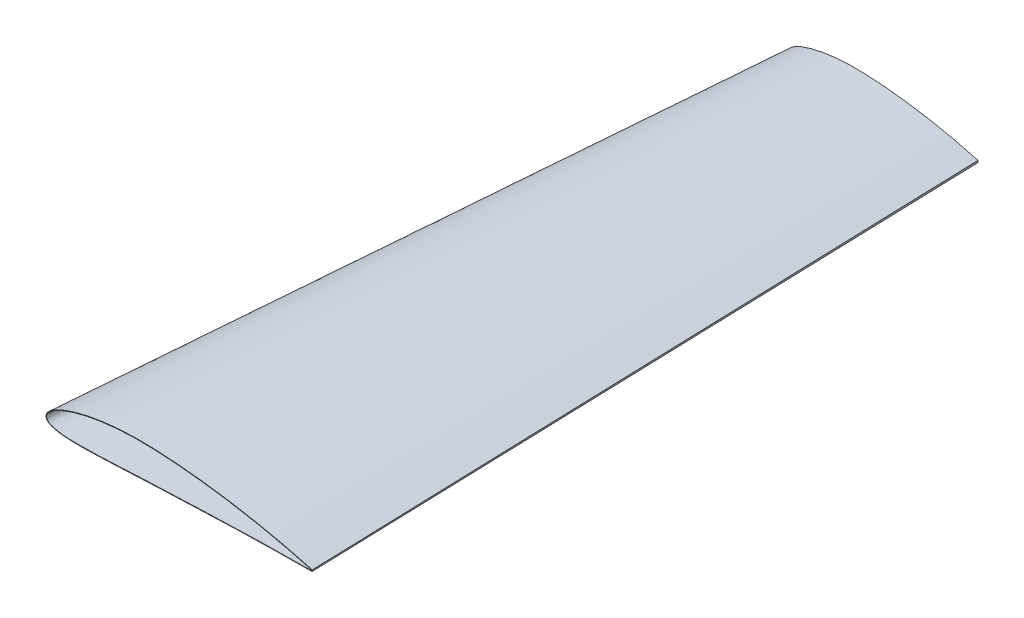
ISO-10303-21;
HEADER;
FILE_DESCRIPTION(('STEP AP214'),'2;1');
FILE_NAME('part.step','',(''),(''),'','','');
FILE_SCHEMA(('AUTOMOTIVE_DESIGN { 1 0 10303 214 1 1 1 1 }'));
ENDSEC;
DATA;
#1=APPLICATION_CONTEXT('core data for automotive mechanical design processes');
#2=APPLICATION_PROTOCOL_DEFINITION('international standard','automotive_design',2000,#1);
#3=PRODUCT_CONTEXT('',#1,'mechanical');
#4=PRODUCT('Part','Part','',(#3));
#5=PRODUCT_RELATED_PRODUCT_CATEGORY('part','',(#4));
#6=PRODUCT_DEFINITION_FORMATION('','',#4);
#7=PRODUCT_DEFINITION_CONTEXT('part definition',#1,'design');
#8=PRODUCT_DEFINITION('design','',#6,#7);
#9=PRODUCT_DEFINITION_SHAPE('','',#8);
#10=(LENGTH_UNIT() NAMED_UNIT(*) SI_UNIT(.MILLI.,.METRE.));
#11=(NAMED_UNIT(*) PLANE_ANGLE_UNIT() SI_UNIT($,.RADIAN.));
#12=(NAMED_UNIT(*) SI_UNIT($,.STERADIAN.) SOLID_ANGLE_UNIT());
#13=UNCERTAINTY_MEASURE_WITH_UNIT(LENGTH_MEASURE(1.E-05),#10,'distance_accuracy_value','');
#14=(GEOMETRIC_REPRESENTATION_CONTEXT(3) GLOBAL_UNCERTAINTY_ASSIGNED_CONTEXT((#13)) GLOBAL_UNIT_ASSIGNED_CONTEXT((#10,
#11,#12)) REPRESENTATION_CONTEXT('',''));
#15=CARTESIAN_POINT('',(0.,0.,0.));
#16=DIRECTION('',(0.,0.,1.));
#17=DIRECTION('',(1.,0.,0.));
#18=AXIS2_PLACEMENT_3D('',#15,#16,#17);
#19=CARTESIAN_POINT('',(515.542466757651,1.37291715323749,0.));
#20=CARTESIAN_POINT('',(473.761354348708,1.91504334392476,-1333.5));
#21=CARTESIAN_POINT('',(504.948186056162,4.31562778068404,0.));
#22=CARTESIAN_POINT('',(466.241241660713,4.00387151815679,-1333.5));
#23=CARTESIAN_POINT('',(483.688630885925,9.95175823918553,0.));
#24=CARTESIAN_POINT('',(451.160493971408,8.03690502890336,-1333.5));
#25=CARTESIAN_POINT('',(440.91840439398,20.2408017386491,0.));
#26=CARTESIAN_POINT('',(420.805599887962,15.3578375738474,-1333.5));
#27=CARTESIAN_POINT('',(397.820792051191,29.0759377638442,0.));
#28=CARTESIAN_POINT('',(390.221957363054,21.65962794748,-1333.5));
#29=CARTESIAN_POINT('',(354.460600672312,36.4782376927597,0.));
#30=CARTESIAN_POINT('',(359.448862171338,26.9396472162238,-1333.5));
#31=CARTESIAN_POINT('',(321.821436127745,41.287280697128,0.));
#32=CARTESIAN_POINT('',(336.282822397605,30.3682918829064,-1333.5));
#33=CARTESIAN_POINT('',(289.075414397088,45.3159399144746,0.));
#34=CARTESIAN_POINT('',(313.039072197383,33.2450825322831,-1333.5));
#35=CARTESIAN_POINT('',(256.234249309476,48.5142512287238,0.));
#36=CARTESIAN_POINT('',(289.723976775768,35.5318134186845,-1333.5));
#37=CARTESIAN_POINT('',(223.317458576892,50.787173233681,0.));
#38=CARTESIAN_POINT('',(266.354818287414,37.1599691175304,-1333.5));
#39=CARTESIAN_POINT('',(190.328241158101,52.0921492363557,0.));
#40=CARTESIAN_POINT('',(242.91690860674,38.106258583374,-1333.5));
#41=CARTESIAN_POINT('',(162.799790856734,51.7149612737425,0.));
#42=CARTESIAN_POINT('',(223.339605024856,37.8569374336063,-1333.5));
#43=CARTESIAN_POINT('',(140.815010685056,50.4814113602434,0.));
#44=CARTESIAN_POINT('',(207.702823599273,36.9927518576321,-1333.5));
#45=CARTESIAN_POINT('',(124.359909385153,49.0521108646724,0.));
#46=CARTESIAN_POINT('',(195.99602938729,35.9854835703815,-1333.5));
#47=CARTESIAN_POINT('',(107.957329171461,47.0863508807158,0.));
#48=CARTESIAN_POINT('',(184.323035776176,34.59573007404,-1333.5));
#49=CARTESIAN_POINT('',(91.631280061329,44.5372092186544,0.));
#50=CARTESIAN_POINT('',(172.700036204777,32.7897404844962,-1333.5));
#51=CARTESIAN_POINT('',(75.4136360051635,41.3429509123251,0.));
#52=CARTESIAN_POINT('',(161.148094659947,30.5229468259909,-1333.5));
#53=CARTESIAN_POINT('',(62.025702194082,38.0735505204426,0.));
#54=CARTESIAN_POINT('',(151.604465980378,28.1992444571214,-1333.5));
#55=CARTESIAN_POINT('',(51.4266197848401,35.0260164169072,0.));
#56=CARTESIAN_POINT('',(144.041887446398,26.0301562795153,-1333.5));
#57=CARTESIAN_POINT('',(43.5465568697689,32.4984583099507,0.));
#58=CARTESIAN_POINT('',(138.41449545024,24.2291788913945,-1333.5));
#59=CARTESIAN_POINT('',(35.7541118725182,29.6956733272348,0.));
#60=CARTESIAN_POINT('',(132.843221370915,22.2293587302536,-1333.5));
#61=CARTESIAN_POINT('',(28.0755124200348,26.5705691180233,0.));
#62=CARTESIAN_POINT('',(127.343608813039,19.9952999808497,-1333.5));
#63=CARTESIAN_POINT('',(20.555874406315,23.0470024261619,0.));
#64=CARTESIAN_POINT('',(121.942599672116,17.4689180578259,-1333.5));
#65=CARTESIAN_POINT('',(14.4837569810482,19.6800078711009,0.));
#66=CARTESIAN_POINT('',(117.559968245804,15.04337614627,-1333.5));
#67=CARTESIAN_POINT('',(9.83082821996991,16.6046362541371,0.));
#68=CARTESIAN_POINT('',(114.174757892656,12.8096231690394,-1333.5));
#69=CARTESIAN_POINT('',(6.4884133940203,14.0525883692153,0.));
#70=CARTESIAN_POINT('',(111.721318113505,10.9395579815021,-1333.5));
#71=CARTESIAN_POINT('',(3.37411745860041,11.1653229429713,0.));
#72=CARTESIAN_POINT('',(109.404447868835,8.79585196070452,-1333.5));
#73=CARTESIAN_POINT('',(1.10893170730452,8.36681188823188,0.));
#74=CARTESIAN_POINT('',(107.664063642287,6.65710221065554,-1333.5));
#75=CARTESIAN_POINT('',(-0.301805281426847,5.74949525675526,0.));
#76=CARTESIAN_POINT('',(106.551977804266,4.5904851843582,-1333.5));
#77=CARTESIAN_POINT('',(-1.01759194588757,3.60243572224438,0.));
#78=CARTESIAN_POINT('',(105.953611387231,2.81739605685466,-1333.5));
#79=CARTESIAN_POINT('',(-1.2495522623254,1.27648595976914,0.));
#80=CARTESIAN_POINT('',(105.759156489465,0.850568134802958,-1333.5));
#81=CARTESIAN_POINT('',(-0.871053522600669,-1.0536259455248,0.));
#82=CARTESIAN_POINT('',(106.089924423004,-1.15154539440468,-1333.5));
#83=CARTESIAN_POINT('',(0.0925312647460494,-3.18620229908168,0.));
#84=CARTESIAN_POINT('',(106.914986624156,-2.95461732726503,-1333.5));
#85=CARTESIAN_POINT('',(1.96587574601528,-5.5997712947529,0.));
#86=CARTESIAN_POINT('',(108.477470245047,-4.94678785829278,-1333.5));
#87=CARTESIAN_POINT('',(4.91676019063022,-7.81472721090731,0.));
#88=CARTESIAN_POINT('',(110.800424548259,-6.66376143743772,-1333.5));
#89=CARTESIAN_POINT('',(8.76335605849131,-9.68666142986385,0.));
#90=CARTESIAN_POINT('',(113.698800911527,-8.06494132796826,-1333.5));
#91=CARTESIAN_POINT('',(12.7457170988457,-11.0838560935036,0.));
#92=CARTESIAN_POINT('',(116.635824452286,-9.08879735743914,-1333.5));
#93=CARTESIAN_POINT('',(16.7924123227071,-12.1621059985243,0.));
#94=CARTESIAN_POINT('',(119.584839473497,-9.87029719797451,-1333.5));
#95=CARTESIAN_POINT('',(22.2359674012003,-13.2958830810498,0.));
#96=CARTESIAN_POINT('',(123.524096136929,-10.6860636031594,-1333.5));
#97=CARTESIAN_POINT('',(29.0875943161226,-14.2923489224896,0.));
#98=CARTESIAN_POINT('',(128.447397124961,-11.3972340966206,-1333.5));
#99=CARTESIAN_POINT('',(37.3368750688352,-15.0677746567505,0.));
#100=CARTESIAN_POINT('',(134.349639581766,-11.947718634808,-1333.5));
#101=CARTESIAN_POINT('',(45.5951521604237,-15.5505139378374,0.));
#102=CARTESIAN_POINT('',(140.242283827755,-12.2886242625503,-1333.5));
#103=CARTESIAN_POINT('',(53.8553570900479,-15.8209667772946,0.));
#104=CARTESIAN_POINT('',(146.127060513623,-12.4782668123123,-1333.5));
#105=CARTESIAN_POINT('',(62.1137750735132,-15.9283521329175,0.));
#106=CARTESIAN_POINT('',(152.003712865923,-12.552064863902,-1333.5));
#107=CARTESIAN_POINT('',(73.1205588589155,-15.9055453611833,0.));
#108=CARTESIAN_POINT('',(159.829522788246,-12.5328344567209,-1333.5));
#109=CARTESIAN_POINT('',(86.8699195436529,-15.6312499740422,0.));
#110=CARTESIAN_POINT('',(169.596582504585,-12.3348738263077,-1333.5));
#111=CARTESIAN_POINT('',(103.354857804001,-15.0577240266216,0.));
#112=CARTESIAN_POINT('',(181.297956986089,-11.9250394308122,-1333.5));
#113=CARTESIAN_POINT('',(119.82883830323,-14.3351980837164,0.));
#114=CARTESIAN_POINT('',(192.985214326049,-11.4106375817264,-1333.5));
#115=CARTESIAN_POINT('',(136.295462455293,-13.5306329693252,0.));
#116=CARTESIAN_POINT('',(204.662814159789,-10.8390693642151,-1333.5));
#117=CARTESIAN_POINT('',(158.245357802019,-12.4217886668498,0.));
#118=CARTESIAN_POINT('',(220.224309063749,-10.0527014635403,-1333.5));
#119=CARTESIAN_POINT('',(185.677219006089,-11.0451104976105,0.));
#120=CARTESIAN_POINT('',(239.663674820272,-9.07928745888814,-1333.5));
#121=CARTESIAN_POINT('',(218.611438330042,-9.79297803817341,0.));
#122=CARTESIAN_POINT('',(263.00207611691,-8.19568423864289,-1333.5));
#123=CARTESIAN_POINT('',(251.555145610756,-8.43171617870903,0.));
#124=CARTESIAN_POINT('',(286.363804333461,-7.22745079121833,-1333.5));
#125=CARTESIAN_POINT('',(284.490185789946,-7.05887027421826,0.));
#126=CARTESIAN_POINT('',(309.70924451459,-6.25554907479826,-1333.5));
#127=CARTESIAN_POINT('',(328.406681851027,-5.3338827127236,0.));
#128=CARTESIAN_POINT('',(340.837133227643,-5.03573266395796,-1333.5));
#129=CARTESIAN_POINT('',(383.311814556076,-3.53289934021423,0.));
#130=CARTESIAN_POINT('',(379.748805846812,-3.76689211807182,-1333.5));
#131=CARTESIAN_POINT('',(449.217902368611,-2.16377935447564,0.));
#132=CARTESIAN_POINT('',(426.454575487254,-2.80665513508761,-1333.5));
#133=CARTESIAN_POINT('',(493.166185563474,-1.76961340399107,0.));
#134=CARTESIAN_POINT('',(457.604517174587,-2.5374479327564,-1333.5));
#135=CARTESIAN_POINT('',(515.140000287505,-1.63716151339865,0.));
#136=CARTESIAN_POINT('',(473.17857996649,-2.44353039794196,-1333.5));
#137=B_SPLINE_SURFACE_WITH_KNOTS('',3,1,((#19,#20),(#21,#22),(#23,#24),(#25,#26),(#27,#28),(#29,
#30),(#31,#32),(#33,#34),(#35,#36),(#37,#38),(#39,#40),(#41,#42),(#43,#44),(#45,#46),(#47,#48),
(#49,#50),(#51,#52),(#53,#54),(#55,#56),(#57,#58),(#59,#60),(#61,#62),(#63,#64),(#65,#66),(#67,
#68),(#69,#70),(#71,#72),(#73,#74),(#75,#76),(#77,#78),(#79,#80),(#81,#82),(#83,#84),(#85,#86),
(#87,#88),(#89,#90),(#91,#92),(#93,#94),(#95,#96),(#97,#98),(#99,#100),(#101,#102),(#103,#104),
(#105,#106),(#107,#108),(#109,#110),(#111,#112),(#113,#114),(#115,#116),(#117,#118),(#119,#120),
(#121,#122),(#123,#124),(#125,#126),(#127,#128),(#129,#130),(#131,#132),(#133,#134),(#135,
#136)),.UNSPECIFIED.,.F.,.F.,.F.,(4,1,1,1,1,1,1,1,1,1,1,1,1,1,1,1,1,1,1,1,1,1,1,1,1,1,1,1,1,1,1,
1,1,1,1,1,1,1,1,1,1,1,1,1,1,1,1,1,1,1,1,1,1,1,1,1,4),(2,2),(0.,0.03125,0.0625,0.125,0.15625,
0.1875,0.21875,0.25,0.28125,0.3125,0.34375,0.359375,0.375,0.390625,0.40625,0.421875,0.4375,
0.4453125,0.453125,0.4609375,0.46875,0.4765625,0.484375,0.48828125,0.4921875,0.49609375,0.5,
0.501953125,0.50390625,0.505859375,0.5078125,0.509765625,0.51171875,0.515625,0.51953125,
0.5234375,0.52734375,0.53125,0.5390625,0.546875,0.5546875,0.5625,0.5703125,0.578125,0.59375,
0.609375,0.625,0.640625,0.65625,0.6875,0.71875,0.75,0.78125,0.8125,0.875,0.9375,1.),(0.,1.),.UNSPECIFIED.);
#138=CARTESIAN_POINT('',(515.542466757651,1.37291715323749,0.));
#139=CARTESIAN_POINT('',(504.948186056162,4.31562778068404,0.));
#140=CARTESIAN_POINT('',(483.688630885925,9.95175823918553,0.));
#141=CARTESIAN_POINT('',(440.91840439398,20.2408017386491,0.));
#142=CARTESIAN_POINT('',(397.820792051191,29.0759377638442,0.));
#143=CARTESIAN_POINT('',(354.460600672312,36.4782376927597,0.));
#144=CARTESIAN_POINT('',(321.821436127745,41.287280697128,0.));
#145=CARTESIAN_POINT('',(289.075414397088,45.3159399144746,0.));
#146=CARTESIAN_POINT('',(256.234249309476,48.5142512287238,0.));
#147=CARTESIAN_POINT('',(223.317458576892,50.787173233681,0.));
#148=CARTESIAN_POINT('',(190.328241158101,52.0921492363557,0.));
#149=CARTESIAN_POINT('',(162.799790856734,51.7149612737425,0.));
#150=CARTESIAN_POINT('',(140.815010685056,50.4814113602434,0.));
#151=CARTESIAN_POINT('',(124.359909385153,49.0521108646724,0.));
#152=CARTESIAN_POINT('',(107.957329171461,47.0863508807158,0.));
#153=CARTESIAN_POINT('',(91.631280061329,44.5372092186544,0.));
#154=CARTESIAN_POINT('',(75.4136360051635,41.3429509123251,0.));
#155=CARTESIAN_POINT('',(62.025702194082,38.0735505204426,0.));
#156=CARTESIAN_POINT('',(51.4266197848401,35.0260164169072,0.));
#157=CARTESIAN_POINT('',(43.5465568697689,32.4984583099507,0.));
#158=CARTESIAN_POINT('',(35.7541118725182,29.6956733272348,0.));
#159=CARTESIAN_POINT('',(28.0755124200348,26.5705691180233,0.));
#160=CARTESIAN_POINT('',(20.555874406315,23.0470024261619,0.));
#161=CARTESIAN_POINT('',(14.4837569810482,19.6800078711009,0.));
#162=CARTESIAN_POINT('',(9.83082821996991,16.6046362541371,0.));
#163=CARTESIAN_POINT('',(6.4884133940203,14.0525883692153,0.));
#164=CARTESIAN_POINT('',(3.37411745860041,11.1653229429713,0.));
#165=CARTESIAN_POINT('',(1.10893170730452,8.36681188823188,0.));
#166=CARTESIAN_POINT('',(-0.301805281426847,5.74949525675526,0.));
#167=CARTESIAN_POINT('',(-1.01759194588757,3.60243572224438,0.));
#168=CARTESIAN_POINT('',(-1.2495522623254,1.27648595976914,0.));
#169=CARTESIAN_POINT('',(-0.871053522600669,-1.0536259455248,0.));
#170=CARTESIAN_POINT('',(0.0925312647460494,-3.18620229908168,0.));
#171=CARTESIAN_POINT('',(1.96587574601528,-5.5997712947529,0.));
#172=CARTESIAN_POINT('',(4.91676019063022,-7.81472721090731,0.));
#173=CARTESIAN_POINT('',(8.76335605849131,-9.68666142986385,0.));
#174=CARTESIAN_POINT('',(12.7457170988457,-11.0838560935036,0.));
#175=CARTESIAN_POINT('',(16.7924123227071,-12.1621059985243,0.));
#176=CARTESIAN_POINT('',(22.2359674012003,-13.2958830810498,0.));
#177=CARTESIAN_POINT('',(29.0875943161226,-14.2923489224896,0.));
#178=CARTESIAN_POINT('',(37.3368750688352,-15.0677746567505,0.));
#179=CARTESIAN_POINT('',(45.5951521604237,-15.5505139378374,0.));
#180=CARTESIAN_POINT('',(53.8553570900479,-15.8209667772946,0.));
#181=CARTESIAN_POINT('',(62.1137750735132,-15.9283521329175,0.));
#182=CARTESIAN_POINT('',(73.1205588589155,-15.9055453611833,0.));
#183=CARTESIAN_POINT('',(86.8699195436529,-15.6312499740422,0.));
#184=CARTESIAN_POINT('',(103.354857804001,-15.0577240266216,0.));
#185=CARTESIAN_POINT('',(119.82883830323,-14.3351980837164,0.));
#186=CARTESIAN_POINT('',(136.295462455293,-13.5306329693252,0.));
#187=CARTESIAN_POINT('',(158.245357802019,-12.4217886668498,0.));
#188=CARTESIAN_POINT('',(185.677219006089,-11.0451104976105,0.));
#189=CARTESIAN_POINT('',(218.611438330042,-9.79297803817341,0.));
#190=CARTESIAN_POINT('',(251.555145610756,-8.43171617870903,0.));
#191=CARTESIAN_POINT('',(284.490185789946,-7.05887027421826,0.));
#192=CARTESIAN_POINT('',(328.406681851027,-5.3338827127236,0.));
#193=CARTESIAN_POINT('',(383.311814556076,-3.53289934021423,0.));
#194=CARTESIAN_POINT('',(449.217902368611,-2.16377935447564,0.));
#195=CARTESIAN_POINT('',(493.166185563474,-1.76961340399107,0.));
#196=CARTESIAN_POINT('',(515.140000287505,-1.63716151339865,0.));
#197=B_SPLINE_CURVE_WITH_KNOTS('',3,(#138,#139,#140,#141,#142,#143,#144,#145,#146,#147,#148,
#149,#150,#151,#152,#153,#154,#155,#156,#157,#158,#159,#160,#161,#162,#163,#164,#165,#166,#167,
#168,#169,#170,#171,#172,#173,#174,#175,#176,#177,#178,#179,#180,#181,#182,#183,#184,#185,#186,
#187,#188,#189,#190,#191,#192,#193,#194,#195,#196),.UNSPECIFIED.,.F.,.F.,(4,1,1,1,1,1,1,1,1,1,1,
1,1,1,1,1,1,1,1,1,1,1,1,1,1,1,1,1,1,1,1,1,1,1,1,1,1,1,1,1,1,1,1,1,1,1,1,1,1,1,1,1,1,1,1,1,4),
(0.,0.03125,0.0625,0.125,0.15625,0.1875,0.21875,0.25,0.28125,0.3125,0.34375,0.359375,0.375,
0.390625,0.40625,0.421875,0.4375,0.4453125,0.453125,0.4609375,0.46875,0.4765625,0.484375,
0.48828125,0.4921875,0.49609375,0.5,0.501953125,0.50390625,0.505859375,0.5078125,0.509765625,
0.51171875,0.515625,0.51953125,0.5234375,0.52734375,0.53125,0.5390625,0.546875,0.5546875,0.5625,
0.5703125,0.578125,0.59375,0.609375,0.625,0.640625,0.65625,0.6875,0.71875,0.75,0.78125,0.8125,
0.875,0.9375,1.),.UNSPECIFIED.);
#198=CARTESIAN_POINT('',(515.542466757651,1.37291715323749,0.));
#199=VERTEX_POINT('',#198);
#200=CARTESIAN_POINT('',(515.140000287505,-1.63716151339865,0.));
#201=VERTEX_POINT('',#200);
#202=EDGE_CURVE('E11',#199,#201,#197,.T.);
#203=DIRECTION('',(-0.0313165474447222,0.000406344388476608,-0.999509434042711));
#204=VECTOR('',#203,1.);
#205=CARTESIAN_POINT('',(494.651910553179,1.64398024858112,-666.75));
#206=LINE('',#205,#204);
#207=CARTESIAN_POINT('',(473.761354348708,1.91504334392476,-1333.5));
#208=VERTEX_POINT('',#207);
#209=EDGE_CURVE('E113',#199,#208,#206,.T.);
#210=CARTESIAN_POINT('',(473.761354348708,1.91504334392476,-1333.5));
#211=CARTESIAN_POINT('',(466.241241660713,4.00387151815679,-1333.5));
#212=CARTESIAN_POINT('',(451.160493971408,8.03690502890336,-1333.5));
#213=CARTESIAN_POINT('',(420.805599887962,15.3578375738474,-1333.5));
#214=CARTESIAN_POINT('',(390.221957363054,21.65962794748,-1333.5));
#215=CARTESIAN_POINT('',(359.448862171338,26.9396472162238,-1333.5));
#216=CARTESIAN_POINT('',(336.282822397605,30.3682918829064,-1333.5));
#217=CARTESIAN_POINT('',(313.039072197383,33.2450825322831,-1333.5));
#218=CARTESIAN_POINT('',(289.723976775768,35.5318134186845,-1333.5));
#219=CARTESIAN_POINT('',(266.354818287414,37.1599691175304,-1333.5));
#220=CARTESIAN_POINT('',(242.91690860674,38.106258583374,-1333.5));
#221=CARTESIAN_POINT('',(223.339605024856,37.8569374336063,-1333.5));
#222=CARTESIAN_POINT('',(207.702823599273,36.9927518576321,-1333.5));
#223=CARTESIAN_POINT('',(195.99602938729,35.9854835703815,-1333.5));
#224=CARTESIAN_POINT('',(184.323035776176,34.59573007404,-1333.5));
#225=CARTESIAN_POINT('',(172.700036204777,32.7897404844962,-1333.5));
#226=CARTESIAN_POINT('',(161.148094659947,30.5229468259909,-1333.5));
#227=CARTESIAN_POINT('',(151.604465980378,28.1992444571214,-1333.5));
#228=CARTESIAN_POINT('',(144.041887446398,26.0301562795153,-1333.5));
#229=CARTESIAN_POINT('',(138.41449545024,24.2291788913945,-1333.5));
#230=CARTESIAN_POINT('',(132.843221370915,22.2293587302536,-1333.5));
#231=CARTESIAN_POINT('',(127.343608813039,19.9952999808497,-1333.5));
#232=CARTESIAN_POINT('',(121.942599672116,17.4689180578259,-1333.5));
#233=CARTESIAN_POINT('',(117.559968245804,15.04337614627,-1333.5));
#234=CARTESIAN_POINT('',(114.174757892656,12.8096231690394,-1333.5));
#235=CARTESIAN_POINT('',(111.721318113505,10.9395579815021,-1333.5));
#236=CARTESIAN_POINT('',(109.404447868835,8.79585196070452,-1333.5));
#237=CARTESIAN_POINT('',(107.664063642287,6.65710221065554,-1333.5));
#238=CARTESIAN_POINT('',(106.551977804266,4.5904851843582,-1333.5));
#239=CARTESIAN_POINT('',(105.953611387231,2.81739605685466,-1333.5));
#240=CARTESIAN_POINT('',(105.759156489465,0.850568134802958,-1333.5));
#241=CARTESIAN_POINT('',(106.089924423004,-1.15154539440468,-1333.5));
#242=CARTESIAN_POINT('',(106.914986624156,-2.95461732726503,-1333.5));
#243=CARTESIAN_POINT('',(108.477470245047,-4.94678785829278,-1333.5));
#244=CARTESIAN_POINT('',(110.800424548259,-6.66376143743772,-1333.5));
#245=CARTESIAN_POINT('',(113.698800911527,-8.06494132796826,-1333.5));
#246=CARTESIAN_POINT('',(116.635824452286,-9.08879735743914,-1333.5));
#247=CARTESIAN_POINT('',(119.584839473497,-9.87029719797451,-1333.5));
#248=CARTESIAN_POINT('',(123.524096136929,-10.6860636031594,-1333.5));
#249=CARTESIAN_POINT('',(128.447397124961,-11.3972340966206,-1333.5));
#250=CARTESIAN_POINT('',(134.349639581766,-11.947718634808,-1333.5));
#251=CARTESIAN_POINT('',(140.242283827755,-12.2886242625503,-1333.5));
#252=CARTESIAN_POINT('',(146.127060513623,-12.4782668123123,-1333.5));
#253=CARTESIAN_POINT('',(152.003712865923,-12.552064863902,-1333.5));
#254=CARTESIAN_POINT('',(159.829522788246,-12.5328344567209,-1333.5));
#255=CARTESIAN_POINT('',(169.596582504585,-12.3348738263077,-1333.5));
#256=CARTESIAN_POINT('',(181.297956986089,-11.9250394308122,-1333.5));
#257=CARTESIAN_POINT('',(192.985214326049,-11.4106375817264,-1333.5));
#258=CARTESIAN_POINT('',(204.662814159789,-10.8390693642151,-1333.5));
#259=CARTESIAN_POINT('',(220.224309063749,-10.0527014635403,-1333.5));
#260=CARTESIAN_POINT('',(239.663674820272,-9.07928745888814,-1333.5));
#261=CARTESIAN_POINT('',(263.00207611691,-8.19568423864289,-1333.5));
#262=CARTESIAN_POINT('',(286.363804333461,-7.22745079121833,-1333.5));
#263=CARTESIAN_POINT('',(309.70924451459,-6.25554907479826,-1333.5));
#264=CARTESIAN_POINT('',(340.837133227643,-5.03573266395796,-1333.5));
#265=CARTESIAN_POINT('',(379.748805846812,-3.76689211807182,-1333.5));
#266=CARTESIAN_POINT('',(426.454575487254,-2.80665513508761,-1333.5));
#267=CARTESIAN_POINT('',(457.604517174587,-2.5374479327564,-1333.5));
#268=CARTESIAN_POINT('',(473.17857996649,-2.44353039794196,-1333.5));
#269=B_SPLINE_CURVE_WITH_KNOTS('',3,(#210,#211,#212,#213,#214,#215,#216,#217,#218,#219,#220,
#221,#222,#223,#224,#225,#226,#227,#228,#229,#230,#231,#232,#233,#234,#235,#236,#237,#238,#239,
#240,#241,#242,#243,#244,#245,#246,#247,#248,#249,#250,#251,#252,#253,#254,#255,#256,#257,#258,
#259,#260,#261,#262,#263,#264,#265,#266,#267,#268),.UNSPECIFIED.,.F.,.F.,(4,1,1,1,1,1,1,1,1,1,1,
1,1,1,1,1,1,1,1,1,1,1,1,1,1,1,1,1,1,1,1,1,1,1,1,1,1,1,1,1,1,1,1,1,1,1,1,1,1,1,1,1,1,1,1,1,4),
(0.,0.03125,0.0625,0.125,0.15625,0.1875,0.21875,0.25,0.28125,0.3125,0.34375,0.359375,0.375,
0.390625,0.40625,0.421875,0.4375,0.4453125,0.453125,0.4609375,0.46875,0.4765625,0.484375,
0.48828125,0.4921875,0.49609375,0.5,0.501953125,0.50390625,0.505859375,0.5078125,0.509765625,
0.51171875,0.515625,0.51953125,0.5234375,0.52734375,0.53125,0.5390625,0.546875,0.5546875,0.5625,
0.5703125,0.578125,0.59375,0.609375,0.625,0.640625,0.65625,0.6875,0.71875,0.75,0.78125,0.8125,
0.875,0.9375,1.),.UNSPECIFIED.);
#270=CARTESIAN_POINT('',(473.17857996649,-2.44353039794196,-1333.5));
#271=VERTEX_POINT('',#270);
#272=EDGE_CURVE('E96',#208,#271,#269,.T.);
#273=DIRECTION('',(-0.0314515585962615,-0.000604401805953986,-0.999505094614491));
#274=VECTOR('',#273,1.);
#275=CARTESIAN_POINT('',(494.159290126997,-2.0403459556703,-666.75));
#276=LINE('',#275,#274);
#277=EDGE_CURVE('E50',#201,#271,#276,.T.);
#278=ORIENTED_EDGE('',*,*,#202,.F.);
#279=ORIENTED_EDGE('',*,*,#209,.T.);
#280=ORIENTED_EDGE('',*,*,#272,.T.);
#281=ORIENTED_EDGE('',*,*,#277,.F.);
#282=EDGE_LOOP('',(#278,#279,#280,#281));
#283=FACE_BOUND('',#282,.T.);
#284=ADVANCED_FACE('F41',(#283),#137,.F.);
#285=CARTESIAN_POINT('',(515.140000287505,-1.63716151339865,0.));
#286=DIRECTION('',(0.99070012302079,-0.132462844212288,-0.0310943909697982));
#287=DIRECTION('',(0.13252692727453,0.991179405328405,0.));
#288=AXIS2_PLACEMENT_3D('',#285,#286,#287);
#289=PLANE('',#288);
#290=DIRECTION('',(0.13252692727453,0.991179405328405,0.));
#291=VECTOR('',#290,1.);
#292=CARTESIAN_POINT('',(515.341233522578,-0.132122180080578,0.));
#293=LINE('',#292,#291);
#294=EDGE_CURVE('E119',#201,#199,#293,.T.);
#295=ORIENTED_EDGE('',*,*,#294,.F.);
#296=ORIENTED_EDGE('',*,*,#277,.T.);
#297=DIRECTION('',(0.13252818509165,0.991179237149524,0.));
#298=VECTOR('',#297,1.);
#299=CARTESIAN_POINT('',(473.469967157599,-0.264243527008601,-1333.5));
#300=LINE('',#299,#298);
#301=EDGE_CURVE('E45',#271,#208,#300,.T.);
#302=ORIENTED_EDGE('',*,*,#301,.T.);
#303=ORIENTED_EDGE('',*,*,#209,.F.);
#304=EDGE_LOOP('',(#295,#296,#302,#303));
#305=FACE_BOUND('',#304,.T.);
#306=ADVANCED_FACE('F43',(#305),#289,.T.);
#307=CARTESIAN_POINT('',(0.789698427813787,7.6809404147223,0.));
#308=DIRECTION('',(0.,0.,1.));
#309=DIRECTION('',(-1.,0.,0.));
#310=AXIS2_PLACEMENT_3D('',#307,#308,#309);
#311=PLANE('',#310);
#312=DIRECTION('',(0.132526927273884,0.991179405328492,0.));
#313=VECTOR('',#312,1.);
#314=CARTESIAN_POINT('',(514.35,0.,0.));
#315=LINE('',#314,#313);
#316=CARTESIAN_POINT('',(514.264104,-0.642423,0.));
#317=VERTEX_POINT('',#316);
#318=CARTESIAN_POINT('',(514.435896,0.642423,0.));
#319=VERTEX_POINT('',#318);
#320=EDGE_CURVE('E88',#317,#319,#315,.T.);
#321=ORIENTED_EDGE('',*,*,#320,.F.);
#322=CARTESIAN_POINT('',(514.435896,0.642423,0.));
#323=CARTESIAN_POINT('',(512.94541606473,1.05642478729432,0.));
#324=CARTESIAN_POINT('',(508.825527987807,2.19256313847687,0.));
#325=CARTESIAN_POINT('',(498.403665900981,5.01203318174744,0.));
#326=CARTESIAN_POINT('',(480.522495849854,9.65821949062991,0.));
#327=CARTESIAN_POINT('',(461.6976352898,14.2178535400194,0.));
#328=CARTESIAN_POINT('',(441.398480906032,18.8488091834658,0.));
#329=CARTESIAN_POINT('',(425.837811960539,22.2064809442018,0.));
#330=CARTESIAN_POINT('',(404.739444713579,26.4880124213888,0.));
#331=CARTESIAN_POINT('',(386.633295981129,29.9022035696143,0.));
#332=CARTESIAN_POINT('',(367.797715069162,33.1789779456841,0.));
#333=CARTESIAN_POINT('',(347.785757595347,36.4491216571071,0.));
#334=CARTESIAN_POINT('',(321.929657212203,40.2530036004365,0.));
#335=CARTESIAN_POINT('',(290.1575236074,44.1855594770424,0.));
#336=CARTESIAN_POINT('',(263.205160570892,46.8408013496332,0.));
#337=CARTESIAN_POINT('',(241.481594589181,48.5315437184497,0.));
#338=CARTESIAN_POINT('',(225.228952555751,49.5578635284934,0.));
#339=CARTESIAN_POINT('',(209.026056900066,50.3454166531266,0.));
#340=CARTESIAN_POINT('',(192.91849394169,50.8313771990957,0.));
#341=CARTESIAN_POINT('',(176.973461880223,50.8910826974378,0.));
#342=CARTESIAN_POINT('',(156.379693514986,50.443365915704,0.));
#343=CARTESIAN_POINT('',(131.753417716594,48.9407852546156,0.));
#344=CARTESIAN_POINT('',(108.05912810278,46.1590202990312,0.));
#345=CARTESIAN_POINT('',(90.3059853486501,43.2428512836833,0.));
#346=CARTESIAN_POINT('',(77.9859974202083,40.8195537307709,0.));
#347=CARTESIAN_POINT('',(66.4275233836712,38.1487409922866,0.));
#348=CARTESIAN_POINT('',(55.6793455107768,35.2676421154893,0.));
#349=CARTESIAN_POINT('',(45.7858241467059,32.2152976573816,0.));
#350=CARTESIAN_POINT('',(36.7859672757282,29.0315137261456,0.));
#351=CARTESIAN_POINT('',(28.7128278267648,25.7579258766505,0.));
#352=CARTESIAN_POINT('',(21.5951478101318,22.4321597042956,0.));
#353=CARTESIAN_POINT('',(15.4550025655565,19.0919579210996,0.));
#354=CARTESIAN_POINT('',(10.3087653268058,15.7705328063585,0.));
#355=CARTESIAN_POINT('',(6.16514914406117,12.4956664129553,0.));
#356=CARTESIAN_POINT('',(3.02641944483636,9.28349534240597,0.));
#357=CARTESIAN_POINT('',(0.892546496087793,6.13234383969225,0.));
#358=CARTESIAN_POINT('',(-0.207749289706149,3.01155653148428,0.));
#359=CARTESIAN_POINT('',(-0.180705806156611,-0.0362548467185213,0.));
#360=CARTESIAN_POINT('',(0.964936352383728,-2.85745424735354,0.));
#361=CARTESIAN_POINT('',(3.15942728449595,-5.31808870006715,0.));
#362=CARTESIAN_POINT('',(6.28988095208388,-7.43127852790095,0.));
#363=CARTESIAN_POINT('',(10.3346827005672,-9.249116332702,0.));
#364=CARTESIAN_POINT('',(15.2853400246204,-10.7963791421872,0.));
#365=CARTESIAN_POINT('',(21.128740187722,-12.0830529684782,0.));
#366=CARTESIAN_POINT('',(27.8434078851453,-13.1181164538871,0.));
#367=CARTESIAN_POINT('',(35.402386955595,-13.909930601921,0.));
#368=CARTESIAN_POINT('',(43.774859618114,-14.4685589897819,0.));
#369=CARTESIAN_POINT('',(52.9268307234789,-14.8088115512827,0.));
#370=CARTESIAN_POINT('',(62.8222991220521,-14.9425562599767,0.));
#371=CARTESIAN_POINT('',(73.4230791296659,-14.8903632448912,0.));
#372=CARTESIAN_POINT('',(84.6899003138328,-14.669251653047,0.));
#373=CARTESIAN_POINT('',(96.5819965888191,-14.3020165903753,0.));
#374=CARTESIAN_POINT('',(113.568649316398,-13.6339776986205,0.));
#375=CARTESIAN_POINT('',(136.038145587383,-12.55213020457,0.));
#376=CARTESIAN_POINT('',(159.255895604522,-11.3625421508041,0.));
#377=CARTESIAN_POINT('',(178.63980440041,-10.426403347717,0.));
#378=CARTESIAN_POINT('',(193.687789822616,-9.74571384869642,0.));
#379=CARTESIAN_POINT('',(209.076975035284,-9.14665953276347,0.));
#380=CARTESIAN_POINT('',(224.747841415959,-8.53645233231427,0.));
#381=CARTESIAN_POINT('',(251.268043050231,-7.44592583941877,0.));
#382=CARTESIAN_POINT('',(288.183310261078,-5.89213782868748,0.));
#383=CARTESIAN_POINT('',(324.855252418006,-4.48957076349408,0.));
#384=CARTESIAN_POINT('',(350.49312127892,-3.63029902647992,0.));
#385=CARTESIAN_POINT('',(378.655916259754,-2.75217689665205,0.));
#386=CARTESIAN_POINT('',(405.834971812742,-2.0685118801751,0.));
#387=CARTESIAN_POINT('',(435.510495417732,-1.50653575485183,0.));
#388=CARTESIAN_POINT('',(456.175948723462,-1.17512970443536,0.));
#389=CARTESIAN_POINT('',(475.257418188367,-0.951341238396082,0.));
#390=CARTESIAN_POINT('',(490.933297619623,-0.80445748931804,0.));
#391=CARTESIAN_POINT('',(500.158698947766,-0.732541232247515,0.));
#392=CARTESIAN_POINT('',(508.450560131903,-0.676259098232435,0.));
#393=CARTESIAN_POINT('',(512.718654990296,-0.651738526034978,0.));
#394=CARTESIAN_POINT('',(514.264104,-0.642423,0.));
#395=B_SPLINE_CURVE_WITH_KNOTS('',3,(#322,#323,#324,#325,#326,#327,#328,#329,#330,#331,#332,
#333,#334,#335,#336,#337,#338,#339,#340,#341,#342,#343,#344,#345,#346,#347,#348,#349,#350,#351,
#352,#353,#354,#355,#356,#357,#358,#359,#360,#361,#362,#363,#364,#365,#366,#367,#368,#369,#370,
#371,#372,#373,#374,#375,#376,#377,#378,#379,#380,#381,#382,#383,#384,#385,#386,#387,#388,#389,
#390,#391,#392,#393,#394),.UNSPECIFIED.,.F.,.F.,(4,1,1,1,1,1,1,1,1,1,1,1,1,1,1,1,1,1,1,1,1,1,1,
1,1,1,1,1,1,1,1,1,1,1,1,1,1,1,1,1,1,1,1,1,1,1,1,1,1,1,1,1,1,1,1,1,1,1,1,1,1,1,1,1,1,1,1,1,1,1,
4),(0.,0.00440644036857422,0.0121737299937428,0.0307541939074956,0.0570317960242728,
0.0673450879951363,0.0900623576232318,0.10237566463772,0.128668991756761,0.142544998543184,
0.15683462681616,0.18642899877217,0.216985200702991,0.248022540320765,0.263568549379391,
0.27905079415257,0.294409505596858,0.30977601328067,0.324950675699587,0.339824563938648,
0.368445781112026,0.395201613054168,0.407751474728481,0.419686063023906,0.43096195418779,
0.441537442035329,0.451376775359951,0.460447411472792,0.468722554437909,0.476182575407291,
0.482814921279424,0.488618662978692,0.493609654903146,0.497829924786717,0.501364693853581,
0.504371830566402,0.507112524612496,0.509853114307978,0.512854812617694,0.516367768618666,
0.52053959257564,0.525445047045249,0.531118392327961,0.537568297479124,0.544788289677284,
0.552761790220897,0.561466342861132,0.570873121381836,0.580950014659322,0.591662173849693,
0.602972463274888,0.614840808775719,0.640086430252391,0.667051539604885,0.681064303706584,
0.695366712683046,0.709960021857495,0.724934164323908,0.740039734181759,0.785567804764558,
0.830182037591703,0.844577388167962,0.858639375621105,0.910443941544171,0.922021682965094,
0.943186534459237,0.969317876146513,0.976379715358717,0.987841938817817,0.99559763857599,1.),.UNSPECIFIED.);
#396=EDGE_CURVE('E84',#319,#317,#395,.T.);
#397=ORIENTED_EDGE('',*,*,#396,.F.);
#398=EDGE_LOOP('',(#321,#397));
#399=FACE_BOUND('',#398,.T.);
#400=ORIENTED_EDGE('',*,*,#294,.T.);
#401=ORIENTED_EDGE('',*,*,#202,.T.);
#402=EDGE_LOOP('',(#400,#401));
#403=FACE_BOUND('',#402,.T.);
#404=ADVANCED_FACE('F91',(#399,#403),#311,.T.);
#405=CARTESIAN_POINT('',(107.40939397805,6.11081318522634,-1333.5));
#406=DIRECTION('',(0.,0.,1.));
#407=DIRECTION('',(-1.,0.,0.));
#408=AXIS2_PLACEMENT_3D('',#405,#406,#407);
#409=PLANE('',#408);
#410=CARTESIAN_POINT('',(471.548210999999,0.454057999987208,-1333.5));
#411=CARTESIAN_POINT('',(470.494753754272,0.746672122477082,-1333.5));
#412=CARTESIAN_POINT('',(467.582858646706,1.5496815807817,-1333.5));
#413=CARTESIAN_POINT('',(460.216788574629,3.54245650519408,-1333.5));
#414=CARTESIAN_POINT('',(447.578553463452,6.82633180706164,-1333.5));
#415=CARTESIAN_POINT('',(434.273328814241,10.0490386732759,-1333.5));
#416=CARTESIAN_POINT('',(419.926087189139,13.3221532297202,-1333.5));
#417=CARTESIAN_POINT('',(408.927959425464,15.6953211175711,-1333.5));
#418=CARTESIAN_POINT('',(394.015842123828,18.7214664036661,-1333.5));
#419=CARTESIAN_POINT('',(381.218595098486,21.1345812654302,-1333.5));
#420=CARTESIAN_POINT('',(367.905792856357,23.4505740973592,-1333.5));
#421=CARTESIAN_POINT('',(353.761538310277,25.7618787300853,-1333.5));
#422=CARTESIAN_POINT('',(335.486701716051,28.4504232108985,-1333.5));
#423=CARTESIAN_POINT('',(313.030471822044,31.2299172839469,-1333.5));
#424=CARTESIAN_POINT('',(293.980807719015,33.1066147362166,-1333.5));
#425=CARTESIAN_POINT('',(278.626806044593,34.3016163153823,-1333.5));
#426=CARTESIAN_POINT('',(267.139599487229,35.0270082162218,-1333.5));
#427=CARTESIAN_POINT('',(255.68755287874,35.5836425109885,-1333.5));
#428=CARTESIAN_POINT('',(244.302886345107,35.927115011996,-1333.5));
#429=CARTESIAN_POINT('',(233.03309484109,35.9693136697484,-1333.5));
#430=CARTESIAN_POINT('',(218.477622951542,35.6528728571563,-1333.5));
#431=CARTESIAN_POINT('',(201.072014755019,34.5908623765454,-1333.5));
#432=CARTESIAN_POINT('',(184.325124716788,32.6247399387227,-1333.5));
#433=CARTESIAN_POINT('',(171.777378415618,30.5636207824256,-1333.5));
#434=CARTESIAN_POINT('',(163.069732670962,28.8508575855725,-1333.5));
#435=CARTESIAN_POINT('',(154.900317065627,26.9631539946023,-1333.5));
#436=CARTESIAN_POINT('',(147.303611251825,24.9268214541628,-1333.5));
#437=CARTESIAN_POINT('',(140.310968151963,22.769453635662,-1333.5));
#438=CARTESIAN_POINT('',(133.949958304024,20.5191869488186,-1333.5));
#439=CARTESIAN_POINT('',(128.243943222938,18.2054477590111,-1333.5));
#440=CARTESIAN_POINT('',(123.213237815739,15.8548286689227,-1333.5));
#441=CARTESIAN_POINT('',(118.873443260835,13.4940076202957,-1333.5));
#442=CARTESIAN_POINT('',(115.236133633843,11.1464567811042,-1333.5));
#443=CARTESIAN_POINT('',(112.307465918484,8.83181420624795,-1333.5));
#444=CARTESIAN_POINT('',(110.08904347215,6.5614828531469,-1333.5));
#445=CARTESIAN_POINT('',(108.580843334353,4.33427994666272,-1333.5));
#446=CARTESIAN_POINT('',(107.80316531111,2.12853842165356,-1333.5));
#447=CARTESIAN_POINT('',(107.822278679744,-0.0256246268723389,-1333.5));
#448=CARTESIAN_POINT('',(108.632008069895,-2.01962024822909,-1333.5));
#449=CARTESIAN_POINT('',(110.183051961843,-3.75877273588915,-1333.5));
#450=CARTESIAN_POINT('',(112.395626013006,-5.25235382542728,-1333.5));
#451=CARTESIAN_POINT('',(115.25445101078,-6.53718512599626,-1333.5));
#452=CARTESIAN_POINT('',(118.753527326803,-7.63077372493691,-1333.5));
#453=CARTESIAN_POINT('',(122.883584864182,-8.5401822189999,-1333.5));
#454=CARTESIAN_POINT('',(127.629445640547,-9.27175628389868,-1333.5));
#455=CARTESIAN_POINT('',(132.972057337769,-9.83140097628574,-1333.5));
#456=CARTESIAN_POINT('',(138.889638054262,-10.2262353599569,-1333.5));
#457=CARTESIAN_POINT('',(145.358160775775,-10.4667209136588,-1333.5));
#458=CARTESIAN_POINT('',(152.352180294713,-10.5612512049219,-1333.5));
#459=CARTESIAN_POINT('',(159.844707071525,-10.5243613303354,-1333.5));
#460=CARTESIAN_POINT('',(167.807985065512,-10.3680815224385,-1333.5));
#461=CARTESIAN_POINT('',(176.213201295296,-10.1085245112694,-1333.5));
#462=CARTESIAN_POINT('',(188.219199631016,-9.63635992298278,-1333.5));
#463=CARTESIAN_POINT('',(204.100417700833,-8.87171960345737,-1333.5));
#464=CARTESIAN_POINT('',(220.510493957693,-8.03093220714318,-1333.5));
#465=CARTESIAN_POINT('',(234.210849069535,-7.36927959083769,-1333.5));
#466=CARTESIAN_POINT('',(244.846616793399,-6.88817544351863,-1333.5));
#467=CARTESIAN_POINT('',(255.72354084923,-6.4647680381547,-1333.5));
#468=CARTESIAN_POINT('',(266.799554765253,-6.03348112050647,-1333.5));
#469=CARTESIAN_POINT('',(285.543771333332,-5.26270616042734,-1333.5));
#470=CARTESIAN_POINT('',(311.635117149994,-4.16450503488361,-1333.5));
#471=CARTESIAN_POINT('',(337.554484160904,-3.17318302443308,-1333.5));
#472=CARTESIAN_POINT('',(355.67507629834,-2.56585970842198,-1333.5));
#473=CARTESIAN_POINT('',(375.580262074813,-1.94521060265128,-1333.5));
#474=CARTESIAN_POINT('',(394.790150732246,-1.4620028025464,-1333.5));
#475=CARTESIAN_POINT('',(415.764516641898,-1.06480467367074,-1333.5));
#476=CARTESIAN_POINT('',(430.370654857757,-0.830568995520572,-1333.5));
#477=CARTESIAN_POINT('',(443.857249442588,-0.672400602459617,-1333.5));
#478=CARTESIAN_POINT('',(454.936805434006,-0.568581926745332,-1333.5));
#479=CARTESIAN_POINT('',(461.457228295663,-0.517751755927463,-1333.5));
#480=CARTESIAN_POINT('',(467.317833669565,-0.477973145484204,-1333.5));
#481=CARTESIAN_POINT('',(470.334484120158,-0.460645014779035,-1333.5));
#482=CARTESIAN_POINT('',(471.426788999999,-0.454058000012805,-1333.5));
#483=B_SPLINE_CURVE_WITH_KNOTS('',3,(#410,#411,#412,#413,#414,#415,#416,#417,#418,#419,#420,
#421,#422,#423,#424,#425,#426,#427,#428,#429,#430,#431,#432,#433,#434,#435,#436,#437,#438,#439,
#440,#441,#442,#443,#444,#445,#446,#447,#448,#449,#450,#451,#452,#453,#454,#455,#456,#457,#458,
#459,#460,#461,#462,#463,#464,#465,#466,#467,#468,#469,#470,#471,#472,#473,#474,#475,#476,#477,
#478,#479,#480,#481,#482),.UNSPECIFIED.,.F.,.F.,(4,1,1,1,1,1,1,1,1,1,1,1,1,1,1,1,1,1,1,1,1,1,1,
1,1,1,1,1,1,1,1,1,1,1,1,1,1,1,1,1,1,1,1,1,1,1,1,1,1,1,1,1,1,1,1,1,1,1,1,1,1,1,1,1,1,1,1,1,1,1,
4),(0.,0.00440644036857422,0.0121737299937428,0.0307541939074956,0.0570317960242728,
0.0673450879951363,0.0900623576232318,0.10237566463772,0.128668991756761,0.142544998543184,
0.15683462681616,0.18642899877217,0.216985200702991,0.248022540320765,0.263568549379391,
0.27905079415257,0.294409505596858,0.30977601328067,0.324950675699587,0.339824563938648,
0.368445781112026,0.395201613054168,0.407751474728481,0.419686063023906,0.43096195418779,
0.441537442035329,0.451376775359951,0.460447411472792,0.468722554437909,0.476182575407291,
0.482814921279424,0.488618662978692,0.493609654903146,0.497829924786717,0.501364693853581,
0.504371830566402,0.507112524612496,0.509853114307978,0.512854812617694,0.516367768618666,
0.52053959257564,0.525445047045249,0.531118392327961,0.537568297479124,0.544788289677284,
0.552761790220897,0.561466342861132,0.570873121381836,0.580950014659322,0.591662173849693,
0.602972463274888,0.614840808775719,0.640086430252391,0.667051539604885,0.681064303706584,
0.695366712683046,0.709960021857495,0.724934164323908,0.740039734181759,0.785567804764558,
0.830182037591703,0.844577388167962,0.858639375621105,0.910443941544171,0.922021682965094,
0.943186534459237,0.969317876146513,0.976379715358717,0.987841938817817,0.99559763857599,1.),.UNSPECIFIED.);
#484=CARTESIAN_POINT('',(471.548210999999,0.454057999987209,-1333.5));
#485=VERTEX_POINT('',#484);
#486=CARTESIAN_POINT('',(471.426788999999,-0.454058000012805,-1333.5));
#487=VERTEX_POINT('',#486);
#488=EDGE_CURVE('E87',#485,#487,#483,.T.);
#489=ORIENTED_EDGE('',*,*,#488,.T.);
#490=DIRECTION('',(0.132528185092149,0.991179237149458,0.));
#491=VECTOR('',#490,1.);
#492=CARTESIAN_POINT('',(471.487499999999,-1.27983561248879E-11,-1333.5));
#493=LINE('',#492,#491);
#494=EDGE_CURVE('E102',#487,#485,#493,.T.);
#495=ORIENTED_EDGE('',*,*,#494,.T.);
#496=EDGE_LOOP('',(#489,#495));
#497=FACE_BOUND('',#496,.T.);
#498=ORIENTED_EDGE('',*,*,#272,.F.);
#499=ORIENTED_EDGE('',*,*,#301,.F.);
#500=EDGE_LOOP('',(#498,#499));
#501=FACE_BOUND('',#500,.T.);
#502=ADVANCED_FACE('F128',(#497,#501),#409,.F.);
#503=CARTESIAN_POINT('',(514.264104,-0.642423,0.));
#504=DIRECTION('',(0.990676755749762,-0.132459719860366,-0.0318431818705373));
#505=DIRECTION('',(0.132526927273884,0.991179405328492,0.));
#506=AXIS2_PLACEMENT_3D('',#503,#504,#505);
#507=PLANE('',#506);
#508=ORIENTED_EDGE('',*,*,#320,.T.);
#509=DIRECTION('',(-0.0321451224088134,-0.000141183092138155,-0.999483202046266));
#510=VECTOR('',#509,1.);
#511=CARTESIAN_POINT('',(492.992053499999,0.548240499993604,-666.75));
#512=LINE('',#511,#510);
#513=EDGE_CURVE('E63',#319,#485,#512,.T.);
#514=ORIENTED_EDGE('',*,*,#513,.T.);
#515=ORIENTED_EDGE('',*,*,#494,.F.);
#516=DIRECTION('',(-0.0321074080934547,0.000141183263356079,-0.999484414292092));
#517=VECTOR('',#516,1.);
#518=CARTESIAN_POINT('',(492.8454465,-0.548240500006403,-666.75));
#519=LINE('',#518,#517);
#520=EDGE_CURVE('E58',#317,#487,#519,.T.);
#521=ORIENTED_EDGE('',*,*,#520,.F.);
#522=EDGE_LOOP('',(#508,#514,#515,#521));
#523=FACE_BOUND('',#522,.T.);
#524=ADVANCED_FACE('F94',(#523),#507,.F.);
#525=CARTESIAN_POINT('',(514.435896,0.642423,0.));
#526=CARTESIAN_POINT('',(471.548210999999,0.454057999987208,-1333.5));
#527=CARTESIAN_POINT('',(512.94541606473,1.05642478729432,0.));
#528=CARTESIAN_POINT('',(470.494753754272,0.746672122477082,-1333.5));
#529=CARTESIAN_POINT('',(508.825527987807,2.19256313847687,0.));
#530=CARTESIAN_POINT('',(467.582858646706,1.5496815807817,-1333.5));
#531=CARTESIAN_POINT('',(498.403665900981,5.01203318174744,0.));
#532=CARTESIAN_POINT('',(460.216788574629,3.54245650519408,-1333.5));
#533=CARTESIAN_POINT('',(480.522495849854,9.65821949062991,0.));
#534=CARTESIAN_POINT('',(447.578553463452,6.82633180706164,-1333.5));
#535=CARTESIAN_POINT('',(461.6976352898,14.2178535400194,0.));
#536=CARTESIAN_POINT('',(434.273328814241,10.0490386732759,-1333.5));
#537=CARTESIAN_POINT('',(441.398480906032,18.8488091834658,0.));
#538=CARTESIAN_POINT('',(419.926087189139,13.3221532297202,-1333.5));
#539=CARTESIAN_POINT('',(425.837811960539,22.2064809442018,0.));
#540=CARTESIAN_POINT('',(408.927959425464,15.6953211175711,-1333.5));
#541=CARTESIAN_POINT('',(404.739444713579,26.4880124213888,0.));
#542=CARTESIAN_POINT('',(394.015842123828,18.7214664036661,-1333.5));
#543=CARTESIAN_POINT('',(386.633295981129,29.9022035696143,0.));
#544=CARTESIAN_POINT('',(381.218595098486,21.1345812654302,-1333.5));
#545=CARTESIAN_POINT('',(367.797715069162,33.1789779456841,0.));
#546=CARTESIAN_POINT('',(367.905792856357,23.4505740973592,-1333.5));
#547=CARTESIAN_POINT('',(347.785757595347,36.4491216571071,0.));
#548=CARTESIAN_POINT('',(353.761538310277,25.7618787300853,-1333.5));
#549=CARTESIAN_POINT('',(321.929657212203,40.2530036004365,0.));
#550=CARTESIAN_POINT('',(335.486701716051,28.4504232108985,-1333.5));
#551=CARTESIAN_POINT('',(290.1575236074,44.1855594770424,0.));
#552=CARTESIAN_POINT('',(313.030471822044,31.2299172839469,-1333.5));
#553=CARTESIAN_POINT('',(263.205160570892,46.8408013496332,0.));
#554=CARTESIAN_POINT('',(293.980807719015,33.1066147362166,-1333.5));
#555=CARTESIAN_POINT('',(241.481594589181,48.5315437184497,0.));
#556=CARTESIAN_POINT('',(278.626806044593,34.3016163153823,-1333.5));
#557=CARTESIAN_POINT('',(225.228952555751,49.5578635284934,0.));
#558=CARTESIAN_POINT('',(267.139599487229,35.0270082162218,-1333.5));
#559=CARTESIAN_POINT('',(209.026056900066,50.3454166531266,0.));
#560=CARTESIAN_POINT('',(255.68755287874,35.5836425109885,-1333.5));
#561=CARTESIAN_POINT('',(192.91849394169,50.8313771990957,0.));
#562=CARTESIAN_POINT('',(244.302886345107,35.927115011996,-1333.5));
#563=CARTESIAN_POINT('',(176.973461880223,50.8910826974378,0.));
#564=CARTESIAN_POINT('',(233.03309484109,35.9693136697484,-1333.5));
#565=CARTESIAN_POINT('',(156.379693514986,50.443365915704,0.));
#566=CARTESIAN_POINT('',(218.477622951542,35.6528728571563,-1333.5));
#567=CARTESIAN_POINT('',(131.753417716594,48.9407852546156,0.));
#568=CARTESIAN_POINT('',(201.072014755019,34.5908623765454,-1333.5));
#569=CARTESIAN_POINT('',(108.05912810278,46.1590202990312,0.));
#570=CARTESIAN_POINT('',(184.325124716788,32.6247399387227,-1333.5));
#571=CARTESIAN_POINT('',(90.3059853486501,43.2428512836833,0.));
#572=CARTESIAN_POINT('',(171.777378415618,30.5636207824256,-1333.5));
#573=CARTESIAN_POINT('',(77.9859974202083,40.8195537307709,0.));
#574=CARTESIAN_POINT('',(163.069732670962,28.8508575855725,-1333.5));
#575=CARTESIAN_POINT('',(66.4275233836712,38.1487409922866,0.));
#576=CARTESIAN_POINT('',(154.900317065627,26.9631539946023,-1333.5));
#577=CARTESIAN_POINT('',(55.6793455107768,35.2676421154893,0.));
#578=CARTESIAN_POINT('',(147.303611251825,24.9268214541628,-1333.5));
#579=CARTESIAN_POINT('',(45.7858241467059,32.2152976573816,0.));
#580=CARTESIAN_POINT('',(140.310968151963,22.769453635662,-1333.5));
#581=CARTESIAN_POINT('',(36.7859672757282,29.0315137261456,0.));
#582=CARTESIAN_POINT('',(133.949958304024,20.5191869488186,-1333.5));
#583=CARTESIAN_POINT('',(28.7128278267648,25.7579258766505,0.));
#584=CARTESIAN_POINT('',(128.243943222938,18.2054477590111,-1333.5));
#585=CARTESIAN_POINT('',(21.5951478101318,22.4321597042956,0.));
#586=CARTESIAN_POINT('',(123.213237815739,15.8548286689227,-1333.5));
#587=CARTESIAN_POINT('',(15.4550025655565,19.0919579210996,0.));
#588=CARTESIAN_POINT('',(118.873443260835,13.4940076202957,-1333.5));
#589=CARTESIAN_POINT('',(10.3087653268058,15.7705328063585,0.));
#590=CARTESIAN_POINT('',(115.236133633843,11.1464567811042,-1333.5));
#591=CARTESIAN_POINT('',(6.16514914406117,12.4956664129553,0.));
#592=CARTESIAN_POINT('',(112.307465918484,8.83181420624795,-1333.5));
#593=CARTESIAN_POINT('',(3.02641944483636,9.28349534240597,0.));
#594=CARTESIAN_POINT('',(110.08904347215,6.5614828531469,-1333.5));
#595=CARTESIAN_POINT('',(0.892546496087793,6.13234383969225,0.));
#596=CARTESIAN_POINT('',(108.580843334353,4.33427994666272,-1333.5));
#597=CARTESIAN_POINT('',(-0.207749289706149,3.01155653148428,0.));
#598=CARTESIAN_POINT('',(107.80316531111,2.12853842165356,-1333.5));
#599=CARTESIAN_POINT('',(-0.180705806156611,-0.0362548467185213,0.));
#600=CARTESIAN_POINT('',(107.822278679744,-0.0256246268723389,-1333.5));
#601=CARTESIAN_POINT('',(0.964936352383728,-2.85745424735354,0.));
#602=CARTESIAN_POINT('',(108.632008069895,-2.01962024822909,-1333.5));
#603=CARTESIAN_POINT('',(3.15942728449595,-5.31808870006715,0.));
#604=CARTESIAN_POINT('',(110.183051961843,-3.75877273588915,-1333.5));
#605=CARTESIAN_POINT('',(6.28988095208388,-7.43127852790095,0.));
#606=CARTESIAN_POINT('',(112.395626013006,-5.25235382542728,-1333.5));
#607=CARTESIAN_POINT('',(10.3346827005672,-9.249116332702,0.));
#608=CARTESIAN_POINT('',(115.25445101078,-6.53718512599626,-1333.5));
#609=CARTESIAN_POINT('',(15.2853400246204,-10.7963791421872,0.));
#610=CARTESIAN_POINT('',(118.753527326803,-7.63077372493691,-1333.5));
#611=CARTESIAN_POINT('',(21.128740187722,-12.0830529684782,0.));
#612=CARTESIAN_POINT('',(122.883584864182,-8.5401822189999,-1333.5));
#613=CARTESIAN_POINT('',(27.8434078851453,-13.1181164538871,0.));
#614=CARTESIAN_POINT('',(127.629445640547,-9.27175628389868,-1333.5));
#615=CARTESIAN_POINT('',(35.402386955595,-13.909930601921,0.));
#616=CARTESIAN_POINT('',(132.972057337769,-9.83140097628574,-1333.5));
#617=CARTESIAN_POINT('',(43.774859618114,-14.4685589897819,0.));
#618=CARTESIAN_POINT('',(138.889638054262,-10.2262353599569,-1333.5));
#619=CARTESIAN_POINT('',(52.9268307234789,-14.8088115512827,0.));
#620=CARTESIAN_POINT('',(145.358160775775,-10.4667209136588,-1333.5));
#621=CARTESIAN_POINT('',(62.8222991220521,-14.9425562599767,0.));
#622=CARTESIAN_POINT('',(152.352180294713,-10.5612512049219,-1333.5));
#623=CARTESIAN_POINT('',(73.4230791296659,-14.8903632448912,0.));
#624=CARTESIAN_POINT('',(159.844707071525,-10.5243613303354,-1333.5));
#625=CARTESIAN_POINT('',(84.6899003138328,-14.669251653047,0.));
#626=CARTESIAN_POINT('',(167.807985065512,-10.3680815224385,-1333.5));
#627=CARTESIAN_POINT('',(96.5819965888191,-14.3020165903753,0.));
#628=CARTESIAN_POINT('',(176.213201295296,-10.1085245112694,-1333.5));
#629=CARTESIAN_POINT('',(113.568649316398,-13.6339776986205,0.));
#630=CARTESIAN_POINT('',(188.219199631016,-9.63635992298278,-1333.5));
#631=CARTESIAN_POINT('',(136.038145587383,-12.55213020457,0.));
#632=CARTESIAN_POINT('',(204.100417700833,-8.87171960345737,-1333.5));
#633=CARTESIAN_POINT('',(159.255895604522,-11.3625421508041,0.));
#634=CARTESIAN_POINT('',(220.510493957693,-8.03093220714318,-1333.5));
#635=CARTESIAN_POINT('',(178.63980440041,-10.426403347717,0.));
#636=CARTESIAN_POINT('',(234.210849069535,-7.36927959083769,-1333.5));
#637=CARTESIAN_POINT('',(193.687789822616,-9.74571384869642,0.));
#638=CARTESIAN_POINT('',(244.846616793399,-6.88817544351863,-1333.5));
#639=CARTESIAN_POINT('',(209.076975035284,-9.14665953276347,0.));
#640=CARTESIAN_POINT('',(255.72354084923,-6.4647680381547,-1333.5));
#641=CARTESIAN_POINT('',(224.747841415959,-8.53645233231427,0.));
#642=CARTESIAN_POINT('',(266.799554765253,-6.03348112050647,-1333.5));
#643=CARTESIAN_POINT('',(251.268043050231,-7.44592583941877,0.));
#644=CARTESIAN_POINT('',(285.543771333332,-5.26270616042734,-1333.5));
#645=CARTESIAN_POINT('',(288.183310261078,-5.89213782868748,0.));
#646=CARTESIAN_POINT('',(311.635117149994,-4.16450503488361,-1333.5));
#647=CARTESIAN_POINT('',(324.855252418006,-4.48957076349408,0.));
#648=CARTESIAN_POINT('',(337.554484160904,-3.17318302443308,-1333.5));
#649=CARTESIAN_POINT('',(350.49312127892,-3.63029902647992,0.));
#650=CARTESIAN_POINT('',(355.67507629834,-2.56585970842198,-1333.5));
#651=CARTESIAN_POINT('',(378.655916259754,-2.75217689665205,0.));
#652=CARTESIAN_POINT('',(375.580262074813,-1.94521060265128,-1333.5));
#653=CARTESIAN_POINT('',(405.834971812742,-2.0685118801751,0.));
#654=CARTESIAN_POINT('',(394.790150732246,-1.4620028025464,-1333.5));
#655=CARTESIAN_POINT('',(435.510495417732,-1.50653575485183,0.));
#656=CARTESIAN_POINT('',(415.764516641898,-1.06480467367074,-1333.5));
#657=CARTESIAN_POINT('',(456.175948723462,-1.17512970443536,0.));
#658=CARTESIAN_POINT('',(430.370654857757,-0.830568995520572,-1333.5));
#659=CARTESIAN_POINT('',(475.257418188367,-0.951341238396082,0.));
#660=CARTESIAN_POINT('',(443.857249442588,-0.672400602459617,-1333.5));
#661=CARTESIAN_POINT('',(490.933297619623,-0.80445748931804,0.));
#662=CARTESIAN_POINT('',(454.936805434006,-0.568581926745332,-1333.5));
#663=CARTESIAN_POINT('',(500.158698947766,-0.732541232247515,0.));
#664=CARTESIAN_POINT('',(461.457228295663,-0.517751755927463,-1333.5));
#665=CARTESIAN_POINT('',(508.450560131903,-0.676259098232435,0.));
#666=CARTESIAN_POINT('',(467.317833669565,-0.477973145484204,-1333.5));
#667=CARTESIAN_POINT('',(512.718654990296,-0.651738526034978,0.));
#668=CARTESIAN_POINT('',(470.334484120158,-0.460645014779035,-1333.5));
#669=CARTESIAN_POINT('',(514.264104,-0.642423,0.));
#670=CARTESIAN_POINT('',(471.426788999999,-0.454058000012805,-1333.5));
#671=B_SPLINE_SURFACE_WITH_KNOTS('',3,1,((#525,#526),(#527,#528),(#529,#530),(#531,#532),(#533,
#534),(#535,#536),(#537,#538),(#539,#540),(#541,#542),(#543,#544),(#545,#546),(#547,#548),(#549,
#550),(#551,#552),(#553,#554),(#555,#556),(#557,#558),(#559,#560),(#561,#562),(#563,#564),(#565,
#566),(#567,#568),(#569,#570),(#571,#572),(#573,#574),(#575,#576),(#577,#578),(#579,#580),(#581,
#582),(#583,#584),(#585,#586),(#587,#588),(#589,#590),(#591,#592),(#593,#594),(#595,#596),(#597,
#598),(#599,#600),(#601,#602),(#603,#604),(#605,#606),(#607,#608),(#609,#610),(#611,#612),(#613,
#614),(#615,#616),(#617,#618),(#619,#620),(#621,#622),(#623,#624),(#625,#626),(#627,#628),(#629,
#630),(#631,#632),(#633,#634),(#635,#636),(#637,#638),(#639,#640),(#641,#642),(#643,#644),(#645,
#646),(#647,#648),(#649,#650),(#651,#652),(#653,#654),(#655,#656),(#657,#658),(#659,#660),(#661,
#662),(#663,#664),(#665,#666),(#667,#668),(#669,#670)),.UNSPECIFIED.,.F.,.F.,.F.,(4,1,1,1,1,1,1,
1,1,1,1,1,1,1,1,1,1,1,1,1,1,1,1,1,1,1,1,1,1,1,1,1,1,1,1,1,1,1,1,1,1,1,1,1,1,1,1,1,1,1,1,1,1,1,1,
1,1,1,1,1,1,1,1,1,1,1,1,1,1,1,4),(2,2),(0.,0.00440644036857422,0.0121737299937428,
0.0307541939074956,0.0570317960242728,0.0673450879951363,0.0900623576232318,0.10237566463772,
0.128668991756761,0.142544998543184,0.15683462681616,0.18642899877217,0.216985200702991,
0.248022540320765,0.263568549379391,0.27905079415257,0.294409505596858,0.30977601328067,
0.324950675699587,0.339824563938648,0.368445781112026,0.395201613054168,0.407751474728481,
0.419686063023906,0.43096195418779,0.441537442035329,0.451376775359951,0.460447411472792,
0.468722554437909,0.476182575407291,0.482814921279424,0.488618662978692,0.493609654903146,
0.497829924786717,0.501364693853581,0.504371830566402,0.507112524612496,0.509853114307978,
0.512854812617694,0.516367768618666,0.52053959257564,0.525445047045249,0.531118392327961,
0.537568297479124,0.544788289677284,0.552761790220897,0.561466342861132,0.570873121381836,
0.580950014659322,0.591662173849693,0.602972463274888,0.614840808775719,0.640086430252391,
0.667051539604885,0.681064303706584,0.695366712683046,0.709960021857495,0.724934164323908,
0.740039734181759,0.785567804764558,0.830182037591703,0.844577388167962,0.858639375621105,
0.910443941544171,0.922021682965094,0.943186534459237,0.969317876146513,0.976379715358717,
0.987841938817817,0.99559763857599,1.),(0.,1.),.UNSPECIFIED.);
#672=ORIENTED_EDGE('',*,*,#396,.T.);
#673=ORIENTED_EDGE('',*,*,#520,.T.);
#674=ORIENTED_EDGE('',*,*,#488,.F.);
#675=ORIENTED_EDGE('',*,*,#513,.F.);
#676=EDGE_LOOP('',(#672,#673,#674,#675));
#677=FACE_BOUND('',#676,.T.);
#678=ADVANCED_FACE('F83',(#677),#671,.T.);
#679=CLOSED_SHELL('',(#284,#306,#404,#502,#524,#678));
#680=MANIFOLD_SOLID_BREP('B2',#679);
#681=ADVANCED_BREP_SHAPE_REPRESENTATION('',(#18,#680),#14);
#682=SHAPE_DEFINITION_REPRESENTATION(#9,#681);
ENDSEC;
END-ISO-10303-21;
